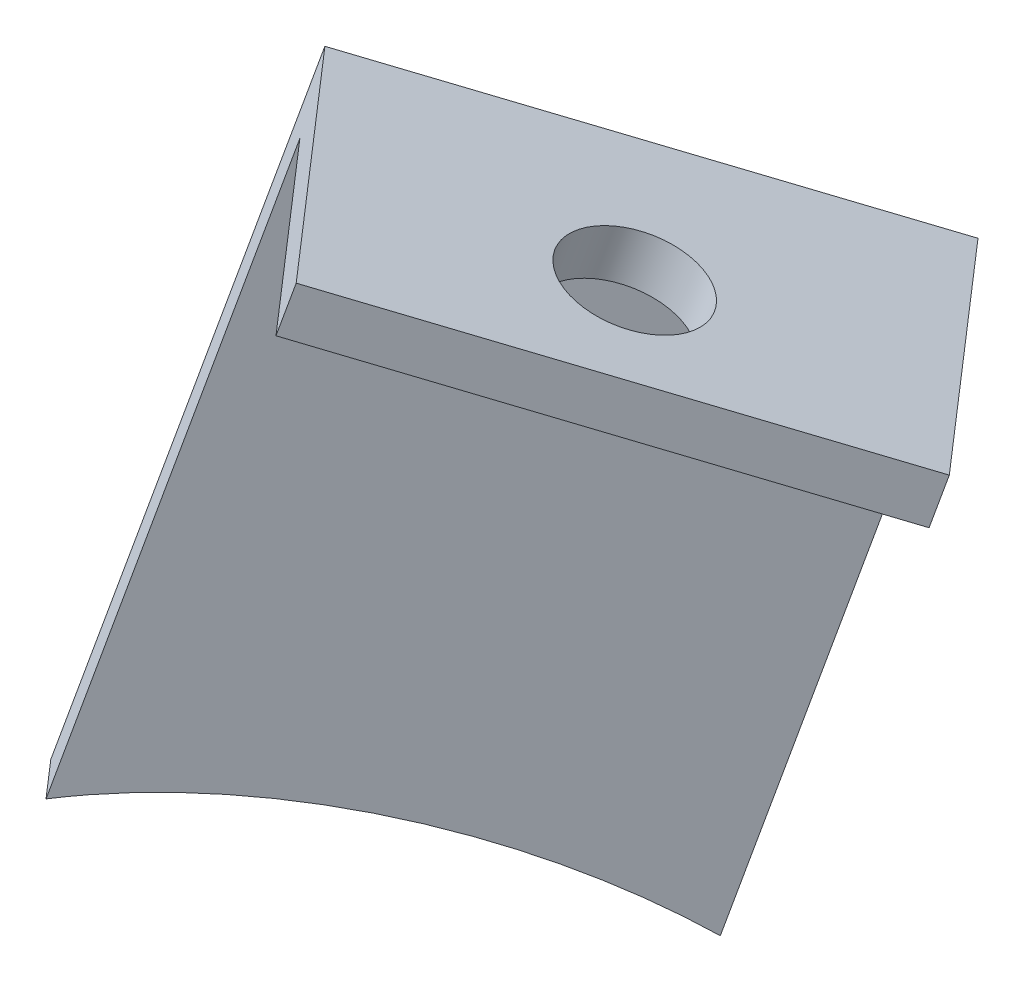
ISO-10303-21;
HEADER;
FILE_DESCRIPTION(('STEP AP214'),'2;1');
FILE_NAME('part.step','',(''),(''),'','','');
FILE_SCHEMA(('AUTOMOTIVE_DESIGN { 1 0 10303 214 1 1 1 1 }'));
ENDSEC;
DATA;
#1=APPLICATION_CONTEXT('core data for automotive mechanical design processes');
#2=APPLICATION_PROTOCOL_DEFINITION('international standard','automotive_design',2000,#1);
#3=PRODUCT_CONTEXT('',#1,'mechanical');
#4=PRODUCT('Part','Part','',(#3));
#5=PRODUCT_RELATED_PRODUCT_CATEGORY('part','',(#4));
#6=PRODUCT_DEFINITION_FORMATION('','',#4);
#7=PRODUCT_DEFINITION_CONTEXT('part definition',#1,'design');
#8=PRODUCT_DEFINITION('design','',#6,#7);
#9=PRODUCT_DEFINITION_SHAPE('','',#8);
#10=(LENGTH_UNIT() NAMED_UNIT(*) SI_UNIT(.MILLI.,.METRE.));
#11=(NAMED_UNIT(*) PLANE_ANGLE_UNIT() SI_UNIT($,.RADIAN.));
#12=(NAMED_UNIT(*) SI_UNIT($,.STERADIAN.) SOLID_ANGLE_UNIT());
#13=UNCERTAINTY_MEASURE_WITH_UNIT(LENGTH_MEASURE(1.E-05),#10,'distance_accuracy_value','');
#14=(GEOMETRIC_REPRESENTATION_CONTEXT(3) GLOBAL_UNCERTAINTY_ASSIGNED_CONTEXT((#13)) GLOBAL_UNIT_ASSIGNED_CONTEXT((#10,
#11,#12)) REPRESENTATION_CONTEXT('',''));
#15=CARTESIAN_POINT('',(0.,0.,0.));
#16=DIRECTION('',(0.,0.,1.));
#17=DIRECTION('',(1.,0.,0.));
#18=AXIS2_PLACEMENT_3D('',#15,#16,#17);
#19=CARTESIAN_POINT('',(795.803473019914,-337.711957076395,-317.413502574479));
#20=DIRECTION('',(0.656059028990515,0.,0.754709580222765));
#21=DIRECTION('',(-0.754709580222765,0.,0.656059028990515));
#22=AXIS2_PLACEMENT_3D('',#19,#20,#21);
#23=PLANE('',#22);
#24=DIRECTION('',(0.223324238678405,0.955216593660168,-0.194132798916043));
#25=VECTOR('',#24,1.);
#26=CARTESIAN_POINT('',(788.39956569233,-337.630660477617,-310.97738412659));
#27=LINE('',#26,#25);
#28=CARTESIAN_POINT('',(788.39956569233,-337.630660477617,-310.97738412659));
#29=VERTEX_POINT('',#28);
#30=CARTESIAN_POINT('',(794.004014070655,-313.658958520988,-315.849256774647));
#31=VERTEX_POINT('',#30);
#32=EDGE_CURVE('E148',#29,#31,#27,.T.);
#33=ORIENTED_EDGE('',*,*,#32,.F.);
#34=CARTESIAN_POINT('',(803.285778869516,-341.547090534745,-323.917771817823));
#35=CARTESIAN_POINT('',(798.678186592342,-337.74352209005,-319.912452958011));
#36=CARTESIAN_POINT('',(793.177264789097,-336.365866812638,-315.130574588686));
#37=CARTESIAN_POINT('',(788.399565692324,-337.630660477618,-310.977384126584));
#38=(BOUNDED_CURVE() B_SPLINE_CURVE(3,(#34,#35,#36,#37),.UNSPECIFIED.,.F.,
.F.) B_SPLINE_CURVE_WITH_KNOTS((4,4),(0.197302396756267,0.338155289959341),
.UNSPECIFIED.) CURVE() GEOMETRIC_REPRESENTATION_ITEM() RATIONAL_B_SPLINE_CURVE((0.522216299101071,
0.482629046398418,0.495947227092236,0.562170841182523)) REPRESENTATION_ITEM(''));
#39=CARTESIAN_POINT('',(803.285778869515,-341.547090534744,-323.917771817822));
#40=VERTEX_POINT('',#39);
#41=EDGE_CURVE('E81',#40,#29,#38,.T.);
#42=ORIENTED_EDGE('',*,*,#41,.F.);
#43=DIRECTION('',(0.223324238678404,0.955216593660168,-0.194132798916043));
#44=VECTOR('',#43,1.);
#45=CARTESIAN_POINT('',(803.285778869515,-341.547090534744,-323.917771817822));
#46=LINE('',#45,#44);
#47=CARTESIAN_POINT('',(808.422236359117,-319.57710888056,-328.382826192893));
#48=VERTEX_POINT('',#47);
#49=EDGE_CURVE('E86',#40,#48,#46,.T.);
#50=ORIENTED_EDGE('',*,*,#49,.T.);
#51=DIRECTION('',(-0.720911114423089,0.295907517978624,0.626678470912309));
#52=VECTOR('',#51,1.);
#53=CARTESIAN_POINT('',(808.422236359117,-319.57710888056,-328.382826192893));
#54=LINE('',#53,#52);
#55=EDGE_CURVE('E140',#48,#31,#54,.T.);
#56=ORIENTED_EDGE('',*,*,#55,.T.);
#57=EDGE_LOOP('',(#33,#42,#50,#56));
#58=FACE_BOUND('',#57,.T.);
#59=ADVANCED_FACE('F37',(#58),#23,.T.);
#60=DIRECTION('',(-0.656059028990508,0.,-0.754709580222771));
#61=VECTOR('',#60,1.);
#62=SURFACE_OF_LINEAR_EXTRUSION('',#38,#61);
#63=CARTESIAN_POINT('',(801.973660811535,-341.547090534745,-325.427190978269));
#64=CARTESIAN_POINT('',(797.366068534361,-337.74352209005,-321.421872118456));
#65=CARTESIAN_POINT('',(791.865146731115,-336.365866812638,-316.639993749131));
#66=CARTESIAN_POINT('',(787.087447634343,-337.630660477618,-312.48680328703));
#67=(BOUNDED_CURVE() B_SPLINE_CURVE(3,(#63,#64,#65,#66),.UNSPECIFIED.,.F.,
.F.) B_SPLINE_CURVE_WITH_KNOTS((4,4),(0.197302396756267,0.338155289959341),
.UNSPECIFIED.) CURVE() GEOMETRIC_REPRESENTATION_ITEM() RATIONAL_B_SPLINE_CURVE((0.522216299101071,
0.482629046398418,0.495947227092236,0.562170841182523)) REPRESENTATION_ITEM(''));
#68=CARTESIAN_POINT('',(801.973660811534,-341.547090534744,-325.427190978268));
#69=VERTEX_POINT('',#68);
#70=CARTESIAN_POINT('',(787.087447634349,-337.630660477617,-312.486803287035));
#71=VERTEX_POINT('',#70);
#72=EDGE_CURVE('E79',#69,#71,#67,.T.);
#73=ORIENTED_EDGE('',*,*,#72,.F.);
#74=DIRECTION('',(-0.656059028990508,0.,-0.754709580222771));
#75=VECTOR('',#74,1.);
#76=CARTESIAN_POINT('',(803.285778869515,-341.547090534744,-323.917771817822));
#77=LINE('',#76,#75);
#78=EDGE_CURVE('E55',#40,#69,#77,.T.);
#79=ORIENTED_EDGE('',*,*,#78,.F.);
#80=ORIENTED_EDGE('',*,*,#41,.T.);
#81=DIRECTION('',(-0.656059028990508,0.,-0.754709580222771));
#82=VECTOR('',#81,1.);
#83=CARTESIAN_POINT('',(788.39956569233,-337.630660477617,-310.97738412659));
#84=LINE('',#83,#82);
#85=EDGE_CURVE('E11',#29,#71,#84,.T.);
#86=ORIENTED_EDGE('',*,*,#85,.T.);
#87=EDGE_LOOP('',(#73,#79,#80,#86));
#88=FACE_BOUND('',#87,.T.);
#89=ADVANCED_FACE('F39',(#88),#62,.T.);
#90=CARTESIAN_POINT('',(788.39956569233,-337.630660477617,-310.97738412659));
#91=DIRECTION('',(0.72091111442309,-0.295907517978618,-0.626678470912311));
#92=DIRECTION('',(0.656059028990508,0.,0.754709580222771));
#93=AXIS2_PLACEMENT_3D('',#90,#91,#92);
#94=PLANE('',#93);
#95=DIRECTION('',(0.223324238678405,0.955216593660168,-0.194132798916043));
#96=VECTOR('',#95,1.);
#97=CARTESIAN_POINT('',(787.087447634349,-337.630660477617,-312.486803287035));
#98=LINE('',#97,#96);
#99=CARTESIAN_POINT('',(793.138544490033,-311.748525333667,-317.746941532923));
#100=VERTEX_POINT('',#99);
#101=EDGE_CURVE('E90',#71,#100,#98,.T.);
#102=ORIENTED_EDGE('',*,*,#101,.F.);
#103=ORIENTED_EDGE('',*,*,#85,.F.);
#104=ORIENTED_EDGE('',*,*,#32,.T.);
#105=DIRECTION('',(-0.656059028990508,0.,-0.754709580222771));
#106=VECTOR('',#105,1.);
#107=CARTESIAN_POINT('',(800.56460436056,-313.658958520988,-308.302160972419));
#108=LINE('',#107,#106);
#109=CARTESIAN_POINT('',(800.56460436056,-313.658958520988,-308.302160972419));
#110=VERTEX_POINT('',#109);
#111=EDGE_CURVE('E91',#110,#31,#108,.T.);
#112=ORIENTED_EDGE('',*,*,#111,.F.);
#113=DIRECTION('',(-0.223324238678425,-0.955216593660159,0.194132798916061));
#114=VECTOR('',#113,1.);
#115=CARTESIAN_POINT('',(801.011252837917,-311.748525333667,-308.690426570252));
#116=LINE('',#115,#114);
#117=CARTESIAN_POINT('',(801.011252837917,-311.748525333667,-308.690426570252));
#118=VERTEX_POINT('',#117);
#119=EDGE_CURVE('E114',#118,#110,#116,.T.);
#120=ORIENTED_EDGE('',*,*,#119,.F.);
#121=DIRECTION('',(-0.656059028990508,0.,-0.754709580222771));
#122=VECTOR('',#121,1.);
#123=CARTESIAN_POINT('',(794.450662548014,-311.748525333667,-316.237522372477));
#124=LINE('',#123,#122);
#125=EDGE_CURVE('E47',#118,#100,#124,.T.);
#126=ORIENTED_EDGE('',*,*,#125,.T.);
#127=EDGE_LOOP('',(#102,#103,#104,#112,#120,#126));
#128=FACE_BOUND('',#127,.T.);
#129=ADVANCED_FACE('F110',(#128),#94,.F.);
#130=CARTESIAN_POINT('',(794.450662548014,-311.748525333667,-316.237522372477));
#131=DIRECTION('',(-0.223324238678409,-0.955216593660166,0.194132798916047));
#132=DIRECTION('',(0.97374178000948,-0.227655322503056,0.));
#133=AXIS2_PLACEMENT_3D('',#130,#131,#132);
#134=PLANE('',#133);
#135=CARTESIAN_POINT('',(804.940068837195,-314.707600513454,-318.730759180489));
#136=DIRECTION('',(0.223324238678409,0.955216593660166,-0.194132798916047));
#137=DIRECTION('',(0.97374178000948,-0.227655322503056,0.));
#138=AXIS2_PLACEMENT_3D('',#135,#136,#137);
#139=CIRCLE('',#138,2.49999999999996);
#140=CARTESIAN_POINT('',(807.374423287219,-315.276738819711,-318.730759180489));
#141=VERTEX_POINT('',#140);
#142=EDGE_CURVE('E146',#141,#141,#139,.T.);
#143=ORIENTED_EDGE('',*,*,#142,.F.);
#144=EDGE_LOOP('',(#143));
#145=FACE_BOUND('',#144,.T.);
#146=DIRECTION('',(0.720911114423091,-0.295907517978623,-0.626678470912308));
#147=VECTOR('',#146,1.);
#148=CARTESIAN_POINT('',(793.138544490033,-311.748525333667,-317.746941532923));
#149=LINE('',#148,#147);
#150=CARTESIAN_POINT('',(807.556766778495,-317.66667569324,-330.280510951169));
#151=VERTEX_POINT('',#150);
#152=EDGE_CURVE('E80',#100,#151,#149,.T.);
#153=ORIENTED_EDGE('',*,*,#152,.F.);
#154=ORIENTED_EDGE('',*,*,#125,.F.);
#155=DIRECTION('',(-0.720911114423088,0.295907517978624,0.62667847091231));
#156=VECTOR('',#155,1.);
#157=CARTESIAN_POINT('',(815.429475126379,-317.66667569324,-321.223995988498));
#158=LINE('',#157,#156);
#159=CARTESIAN_POINT('',(815.429475126379,-317.66667569324,-321.223995988498));
#160=VERTEX_POINT('',#159);
#161=EDGE_CURVE('E120',#160,#118,#158,.T.);
#162=ORIENTED_EDGE('',*,*,#161,.F.);
#163=DIRECTION('',(-0.656059028990508,0.,-0.754709580222771));
#164=VECTOR('',#163,1.);
#165=CARTESIAN_POINT('',(808.868884836476,-317.66667569324,-328.771091790723));
#166=LINE('',#165,#164);
#167=EDGE_CURVE('E88',#160,#151,#166,.T.);
#168=ORIENTED_EDGE('',*,*,#167,.T.);
#169=EDGE_LOOP('',(#153,#154,#162,#168));
#170=FACE_BOUND('',#169,.T.);
#171=ADVANCED_FACE('F117',(#145,#170),#134,.F.);
#172=CARTESIAN_POINT('',(803.285778869515,-341.547090534744,-323.917771817822));
#173=DIRECTION('',(0.720911114423091,-0.295907517978617,-0.626678470912311));
#174=DIRECTION('',(0.656059028990508,0.,0.754709580222771));
#175=AXIS2_PLACEMENT_3D('',#172,#173,#174);
#176=PLANE('',#175);
#177=DIRECTION('',(0.223324238678404,0.955216593660168,-0.194132798916043));
#178=VECTOR('',#177,1.);
#179=CARTESIAN_POINT('',(801.973660811534,-341.547090534744,-325.427190978268));
#180=LINE('',#179,#178);
#181=EDGE_CURVE('E72',#69,#151,#180,.T.);
#182=ORIENTED_EDGE('',*,*,#181,.T.);
#183=ORIENTED_EDGE('',*,*,#167,.F.);
#184=DIRECTION('',(0.223324238678425,0.955216593660159,-0.194132798916061));
#185=VECTOR('',#184,1.);
#186=CARTESIAN_POINT('',(814.982826649022,-319.57710888056,-320.835730390666));
#187=LINE('',#186,#185);
#188=CARTESIAN_POINT('',(814.982826649022,-319.57710888056,-320.835730390666));
#189=VERTEX_POINT('',#188);
#190=EDGE_CURVE('E136',#189,#160,#187,.T.);
#191=ORIENTED_EDGE('',*,*,#190,.F.);
#192=DIRECTION('',(-0.656059028990508,0.,-0.754709580222771));
#193=VECTOR('',#192,1.);
#194=CARTESIAN_POINT('',(814.982826649022,-319.57710888056,-320.835730390666));
#195=LINE('',#194,#193);
#196=EDGE_CURVE('E95',#189,#48,#195,.T.);
#197=ORIENTED_EDGE('',*,*,#196,.T.);
#198=ORIENTED_EDGE('',*,*,#49,.F.);
#199=ORIENTED_EDGE('',*,*,#78,.T.);
#200=EDGE_LOOP('',(#182,#183,#191,#197,#198,#199));
#201=FACE_BOUND('',#200,.T.);
#202=ADVANCED_FACE('F83',(#201),#176,.T.);
#203=CARTESIAN_POINT('',(794.491354961933,-337.711957076395,-318.922921734924));
#204=DIRECTION('',(0.656059028990515,0.,0.754709580222765));
#205=DIRECTION('',(-0.754709580222765,0.,0.656059028990515));
#206=AXIS2_PLACEMENT_3D('',#203,#204,#205);
#207=PLANE('',#206);
#208=ORIENTED_EDGE('',*,*,#72,.T.);
#209=ORIENTED_EDGE('',*,*,#101,.T.);
#210=ORIENTED_EDGE('',*,*,#152,.T.);
#211=ORIENTED_EDGE('',*,*,#181,.F.);
#212=EDGE_LOOP('',(#208,#209,#210,#211));
#213=FACE_BOUND('',#212,.T.);
#214=ADVANCED_FACE('F77',(#213),#207,.F.);
#215=CARTESIAN_POINT('',(814.982826649022,-319.57710888056,-320.835730390666));
#216=DIRECTION('',(0.223324238678409,0.955216593660166,-0.194132798916048));
#217=DIRECTION('',(-0.973741780009479,0.227655322503057,0.));
#218=AXIS2_PLACEMENT_3D('',#215,#216,#217);
#219=PLANE('',#218);
#220=CARTESIAN_POINT('',(804.493420359838,-316.618033700774,-318.342493582657));
#221=DIRECTION('',(0.22332423867841,0.955216593660166,-0.194132798916048));
#222=DIRECTION('',(0.973741780009479,-0.227655322503057,0.));
#223=AXIS2_PLACEMENT_3D('',#220,#221,#222);
#224=CIRCLE('',#223,2.49999999999996);
#225=CARTESIAN_POINT('',(806.927774809862,-317.187172007032,-318.342493582657));
#226=VERTEX_POINT('',#225);
#227=EDGE_CURVE('E162',#226,#226,#224,.T.);
#228=ORIENTED_EDGE('',*,*,#227,.T.);
#229=EDGE_LOOP('',(#228));
#230=FACE_BOUND('',#229,.T.);
#231=ORIENTED_EDGE('',*,*,#55,.F.);
#232=ORIENTED_EDGE('',*,*,#196,.F.);
#233=DIRECTION('',(-0.720911114423089,0.295907517978624,0.626678470912309));
#234=VECTOR('',#233,1.);
#235=CARTESIAN_POINT('',(814.982826649022,-319.57710888056,-320.835730390666));
#236=LINE('',#235,#234);
#237=EDGE_CURVE('E145',#189,#110,#236,.T.);
#238=ORIENTED_EDGE('',*,*,#237,.T.);
#239=ORIENTED_EDGE('',*,*,#111,.T.);
#240=EDGE_LOOP('',(#231,#232,#238,#239));
#241=FACE_BOUND('',#240,.T.);
#242=ADVANCED_FACE('F141',(#230,#241),#219,.F.);
#243=CARTESIAN_POINT('',(191.922880158914,8.3059509659947E-12,220.782017957674));
#244=DIRECTION('',(-0.656059028990508,0.,-0.754709580222771));
#245=DIRECTION('',(0.754709580222771,0.,-0.656059028990508));
#246=AXIS2_PLACEMENT_3D('',#243,#244,#245);
#247=PLANE('',#246);
#248=ORIENTED_EDGE('',*,*,#237,.F.);
#249=ORIENTED_EDGE('',*,*,#190,.T.);
#250=ORIENTED_EDGE('',*,*,#161,.T.);
#251=ORIENTED_EDGE('',*,*,#119,.T.);
#252=EDGE_LOOP('',(#248,#249,#250,#251));
#253=FACE_BOUND('',#252,.T.);
#254=ADVANCED_FACE('F170',(#253),#247,.F.);
#255=CARTESIAN_POINT('',(805.833365791909,-310.886734138813,-319.507290376153));
#256=DIRECTION('',(-0.223324238678409,-0.955216593660166,0.194132798916048));
#257=DIRECTION('',(0.973741780009479,-0.227655322503057,0.));
#258=AXIS2_PLACEMENT_3D('',#255,#256,#257);
#259=CYLINDRICAL_SURFACE('',#258,2.49999999999996);
#260=ORIENTED_EDGE('',*,*,#227,.F.);
#261=EDGE_LOOP('',(#260));
#262=FACE_BOUND('',#261,.T.);
#263=ORIENTED_EDGE('',*,*,#142,.T.);
#264=EDGE_LOOP('',(#263));
#265=FACE_BOUND('',#264,.T.);
#266=ADVANCED_FACE('F167',(#262,#265),#259,.F.);
#267=CLOSED_SHELL('',(#59,#89,#129,#171,#202,#214,#242,#254,#266));
#268=MANIFOLD_SOLID_BREP('B2',#267);
#269=ADVANCED_BREP_SHAPE_REPRESENTATION('',(#18,#268),#14);
#270=SHAPE_DEFINITION_REPRESENTATION(#9,#269);
ENDSEC;
END-ISO-10303-21;
